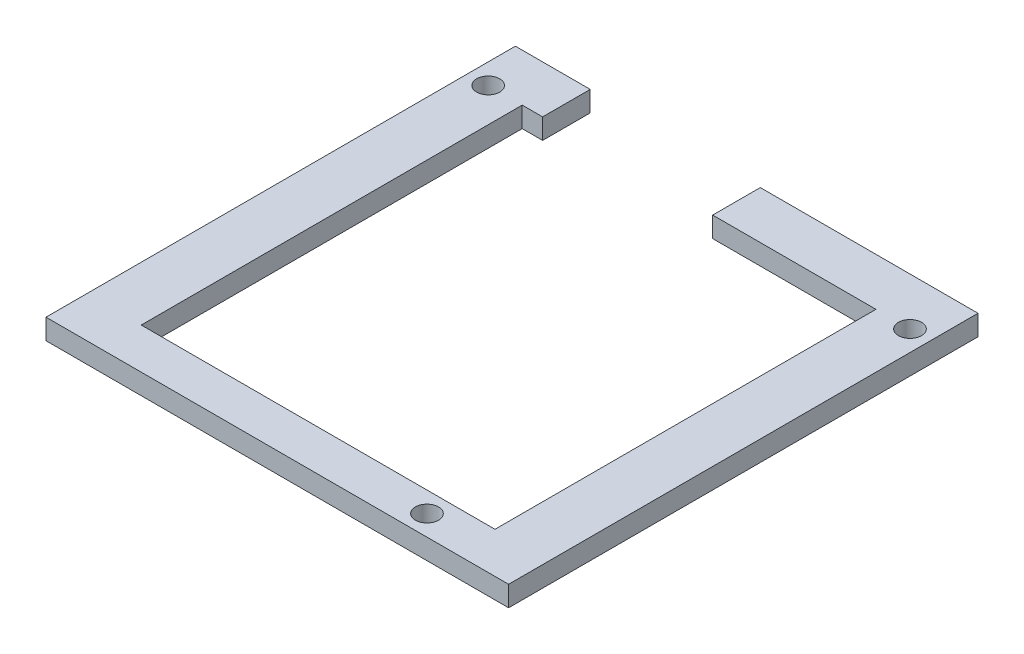
ISO-10303-21;
HEADER;
FILE_DESCRIPTION(('STEP AP214'),'2;1');
FILE_NAME('part.step','',(''),(''),'','','');
FILE_SCHEMA(('AUTOMOTIVE_DESIGN { 1 0 10303 214 1 1 1 1 }'));
ENDSEC;
DATA;
#1=APPLICATION_CONTEXT('core data for automotive mechanical design processes');
#2=APPLICATION_PROTOCOL_DEFINITION('international standard','automotive_design',2000,#1);
#3=PRODUCT_CONTEXT('',#1,'mechanical');
#4=PRODUCT('Part','Part','',(#3));
#5=PRODUCT_RELATED_PRODUCT_CATEGORY('part','',(#4));
#6=PRODUCT_DEFINITION_FORMATION('','',#4);
#7=PRODUCT_DEFINITION_CONTEXT('part definition',#1,'design');
#8=PRODUCT_DEFINITION('design','',#6,#7);
#9=PRODUCT_DEFINITION_SHAPE('','',#8);
#10=(LENGTH_UNIT() NAMED_UNIT(*) SI_UNIT(.MILLI.,.METRE.));
#11=(NAMED_UNIT(*) PLANE_ANGLE_UNIT() SI_UNIT($,.RADIAN.));
#12=(NAMED_UNIT(*) SI_UNIT($,.STERADIAN.) SOLID_ANGLE_UNIT());
#13=UNCERTAINTY_MEASURE_WITH_UNIT(LENGTH_MEASURE(1.E-05),#10,'distance_accuracy_value','');
#14=(GEOMETRIC_REPRESENTATION_CONTEXT(3) GLOBAL_UNCERTAINTY_ASSIGNED_CONTEXT((#13)) GLOBAL_UNIT_ASSIGNED_CONTEXT((#10,
#11,#12)) REPRESENTATION_CONTEXT('',''));
#15=CARTESIAN_POINT('',(0.,0.,0.));
#16=DIRECTION('',(0.,0.,1.));
#17=DIRECTION('',(1.,0.,0.));
#18=AXIS2_PLACEMENT_3D('',#15,#16,#17);
#19=CARTESIAN_POINT('',(-31.6988745927811,20.8489488177002,28.4869749490172));
#20=DIRECTION('',(0.,0.,1.));
#21=DIRECTION('',(1.,0.,0.));
#22=AXIS2_PLACEMENT_3D('',#19,#20,#21);
#23=PLANE('',#22);
#24=DIRECTION('',(-1.,0.,0.));
#25=VECTOR('',#24,1.);
#26=CARTESIAN_POINT('',(-31.6988745927811,17.8489488177002,28.4869749490172));
#27=LINE('',#26,#25);
#28=CARTESIAN_POINT('',(20.3011254072189,17.8489488177002,28.4869749490172));
#29=VERTEX_POINT('',#28);
#30=CARTESIAN_POINT('',(-3.69887459278107,17.8489488177001,28.4869749490172));
#31=VERTEX_POINT('',#30);
#32=EDGE_CURVE('E170',#29,#31,#27,.T.);
#33=ORIENTED_EDGE('',*,*,#32,.F.);
#34=DIRECTION('',(0.,-1.,0.));
#35=VECTOR('',#34,1.);
#36=CARTESIAN_POINT('',(20.3011254072189,20.8489488177002,28.4869749490172));
#37=LINE('',#36,#35);
#38=CARTESIAN_POINT('',(20.3011254072189,20.8489488177002,28.4869749490172));
#39=VERTEX_POINT('',#38);
#40=EDGE_CURVE('E53',#39,#29,#37,.T.);
#41=ORIENTED_EDGE('',*,*,#40,.F.);
#42=DIRECTION('',(-1.,0.,0.));
#43=VECTOR('',#42,1.);
#44=CARTESIAN_POINT('',(-31.6988745927811,20.8489488177002,28.4869749490172));
#45=LINE('',#44,#43);
#46=CARTESIAN_POINT('',(-3.69887459278107,20.8489488177002,28.4869749490172));
#47=VERTEX_POINT('',#46);
#48=EDGE_CURVE('E169',#39,#47,#45,.T.);
#49=ORIENTED_EDGE('',*,*,#48,.T.);
#50=DIRECTION('',(0.,1.,0.));
#51=VECTOR('',#50,1.);
#52=CARTESIAN_POINT('',(-3.69887459278107,-8.11256115379419,28.4869749490172));
#53=LINE('',#52,#51);
#54=EDGE_CURVE('E210',#31,#47,#53,.T.);
#55=ORIENTED_EDGE('',*,*,#54,.F.);
#56=EDGE_LOOP('',(#33,#41,#49,#55));
#57=FACE_BOUND('',#56,.T.);
#58=ADVANCED_FACE('F38',(#57),#23,.T.);
#59=CARTESIAN_POINT('',(-39.6988745927811,20.8489488177002,90.4869749490172));
#60=DIRECTION('',(1.,0.,0.));
#61=DIRECTION('',(0.,0.,-1.));
#62=AXIS2_PLACEMENT_3D('',#59,#60,#61);
#63=PLANE('',#62);
#64=DIRECTION('',(0.,0.,1.));
#65=VECTOR('',#64,1.);
#66=CARTESIAN_POINT('',(-39.6988745927811,17.8489488177002,90.4869749490172));
#67=LINE('',#66,#65);
#68=CARTESIAN_POINT('',(-39.6988745927811,17.8489488177002,21.4869749490172));
#69=VERTEX_POINT('',#68);
#70=CARTESIAN_POINT('',(-39.6988745927811,17.8489488177002,90.4869749490172));
#71=VERTEX_POINT('',#70);
#72=EDGE_CURVE('E144',#69,#71,#67,.T.);
#73=ORIENTED_EDGE('',*,*,#72,.T.);
#74=DIRECTION('',(0.,-1.,0.));
#75=VECTOR('',#74,1.);
#76=CARTESIAN_POINT('',(-39.6988745927811,20.8489488177002,90.4869749490172));
#77=LINE('',#76,#75);
#78=CARTESIAN_POINT('',(-39.6988745927811,20.8489488177002,90.4869749490172));
#79=VERTEX_POINT('',#78);
#80=EDGE_CURVE('E11',#79,#71,#77,.T.);
#81=ORIENTED_EDGE('',*,*,#80,.F.);
#82=DIRECTION('',(0.,0.,1.));
#83=VECTOR('',#82,1.);
#84=CARTESIAN_POINT('',(-39.6988745927811,20.8489488177002,90.4869749490172));
#85=LINE('',#84,#83);
#86=CARTESIAN_POINT('',(-39.6988745927811,20.8489488177002,21.4869749490172));
#87=VERTEX_POINT('',#86);
#88=EDGE_CURVE('E143',#87,#79,#85,.T.);
#89=ORIENTED_EDGE('',*,*,#88,.F.);
#90=DIRECTION('',(0.,1.,0.));
#91=VECTOR('',#90,1.);
#92=CARTESIAN_POINT('',(-39.6988745927811,20.8489488177002,21.4869749490172));
#93=LINE('',#92,#91);
#94=EDGE_CURVE('E199',#69,#87,#93,.T.);
#95=ORIENTED_EDGE('',*,*,#94,.F.);
#96=EDGE_LOOP('',(#73,#81,#89,#95));
#97=FACE_BOUND('',#96,.T.);
#98=ADVANCED_FACE('F40',(#97),#63,.F.);
#99=CARTESIAN_POINT('',(-39.6988745927811,20.8489488177002,90.4869749490172));
#100=DIRECTION('',(0.,0.,-1.));
#101=DIRECTION('',(-1.,0.,0.));
#102=AXIS2_PLACEMENT_3D('',#99,#100,#101);
#103=PLANE('',#102);
#104=DIRECTION('',(-1.,0.,0.));
#105=VECTOR('',#104,1.);
#106=CARTESIAN_POINT('',(-39.6988745927811,17.8489488177002,90.4869749490172));
#107=LINE('',#106,#105);
#108=CARTESIAN_POINT('',(28.3011254072189,17.8489488177002,90.4869749490172));
#109=VERTEX_POINT('',#108);
#110=EDGE_CURVE('E136',#109,#71,#107,.T.);
#111=ORIENTED_EDGE('',*,*,#110,.F.);
#112=DIRECTION('',(0.,-1.,0.));
#113=VECTOR('',#112,1.);
#114=CARTESIAN_POINT('',(28.3011254072189,20.8489488177002,90.4869749490172));
#115=LINE('',#114,#113);
#116=CARTESIAN_POINT('',(28.3011254072189,20.8489488177002,90.4869749490172));
#117=VERTEX_POINT('',#116);
#118=EDGE_CURVE('E46',#117,#109,#115,.T.);
#119=ORIENTED_EDGE('',*,*,#118,.F.);
#120=DIRECTION('',(1.,0.,0.));
#121=VECTOR('',#120,1.);
#122=CARTESIAN_POINT('',(-39.6988745927811,20.8489488177002,90.4869749490172));
#123=LINE('',#122,#121);
#124=EDGE_CURVE('E61',#79,#117,#123,.T.);
#125=ORIENTED_EDGE('',*,*,#124,.F.);
#126=ORIENTED_EDGE('',*,*,#80,.T.);
#127=EDGE_LOOP('',(#111,#119,#125,#126));
#128=FACE_BOUND('',#127,.T.);
#129=ADVANCED_FACE('F147',(#128),#103,.F.);
#130=CARTESIAN_POINT('',(28.3011254072189,20.8489488177002,90.4869749490172));
#131=DIRECTION('',(-1.,0.,0.));
#132=DIRECTION('',(0.,0.,1.));
#133=AXIS2_PLACEMENT_3D('',#130,#131,#132);
#134=PLANE('',#133);
#135=ORIENTED_EDGE('',*,*,#118,.T.);
#136=DIRECTION('',(0.,0.,-1.));
#137=VECTOR('',#136,1.);
#138=CARTESIAN_POINT('',(28.3011254072189,17.8489488177002,90.4869749490172));
#139=LINE('',#138,#137);
#140=CARTESIAN_POINT('',(28.3011254072189,17.8489488177002,21.4869749490172));
#141=VERTEX_POINT('',#140);
#142=EDGE_CURVE('E130',#109,#141,#139,.T.);
#143=ORIENTED_EDGE('',*,*,#142,.T.);
#144=DIRECTION('',(0.,-1.,0.));
#145=VECTOR('',#144,1.);
#146=CARTESIAN_POINT('',(28.3011254072189,20.8489488177002,21.4869749490172));
#147=LINE('',#146,#145);
#148=CARTESIAN_POINT('',(28.3011254072189,20.8489488177002,21.4869749490172));
#149=VERTEX_POINT('',#148);
#150=EDGE_CURVE('E204',#149,#141,#147,.T.);
#151=ORIENTED_EDGE('',*,*,#150,.F.);
#152=DIRECTION('',(0.,0.,-1.));
#153=VECTOR('',#152,1.);
#154=CARTESIAN_POINT('',(28.3011254072189,20.8489488177002,90.4869749490172));
#155=LINE('',#154,#153);
#156=EDGE_CURVE('E153',#117,#149,#155,.T.);
#157=ORIENTED_EDGE('',*,*,#156,.F.);
#158=EDGE_LOOP('',(#135,#143,#151,#157));
#159=FACE_BOUND('',#158,.T.);
#160=ADVANCED_FACE('F152',(#159),#134,.F.);
#161=CARTESIAN_POINT('',(-31.6988745927811,20.8489488177002,28.4869749490172));
#162=DIRECTION('',(1.,0.,0.));
#163=DIRECTION('',(0.,0.,-1.));
#164=AXIS2_PLACEMENT_3D('',#161,#162,#163);
#165=PLANE('',#164);
#166=DIRECTION('',(0.,-1.,0.));
#167=VECTOR('',#166,1.);
#168=CARTESIAN_POINT('',(-31.6988745927811,20.8489488177002,84.4869749490172));
#169=LINE('',#168,#167);
#170=CARTESIAN_POINT('',(-31.6988745927811,20.8489488177002,84.4869749490172));
#171=VERTEX_POINT('',#170);
#172=CARTESIAN_POINT('',(-31.6988745927811,17.8489488177002,84.4869749490172));
#173=VERTEX_POINT('',#172);
#174=EDGE_CURVE('E156',#171,#173,#169,.T.);
#175=ORIENTED_EDGE('',*,*,#174,.T.);
#176=DIRECTION('',(0.,0.,-1.));
#177=VECTOR('',#176,1.);
#178=CARTESIAN_POINT('',(-31.6988745927811,17.8489488177002,28.4869749490172));
#179=LINE('',#178,#177);
#180=CARTESIAN_POINT('',(-31.6988745927811,17.8489488177002,28.4869749490172));
#181=VERTEX_POINT('',#180);
#182=EDGE_CURVE('E223',#173,#181,#179,.T.);
#183=ORIENTED_EDGE('',*,*,#182,.T.);
#184=DIRECTION('',(0.,-1.,0.));
#185=VECTOR('',#184,1.);
#186=CARTESIAN_POINT('',(-31.6988745927811,20.8489488177002,28.4869749490172));
#187=LINE('',#186,#185);
#188=CARTESIAN_POINT('',(-31.6988745927811,20.8489488177002,28.4869749490172));
#189=VERTEX_POINT('',#188);
#190=EDGE_CURVE('E166',#189,#181,#187,.T.);
#191=ORIENTED_EDGE('',*,*,#190,.F.);
#192=DIRECTION('',(0.,0.,1.));
#193=VECTOR('',#192,1.);
#194=CARTESIAN_POINT('',(-31.6988745927811,20.8489488177002,28.4869749490172));
#195=LINE('',#194,#193);
#196=EDGE_CURVE('E173',#189,#171,#195,.T.);
#197=ORIENTED_EDGE('',*,*,#196,.T.);
#198=EDGE_LOOP('',(#175,#183,#191,#197));
#199=FACE_BOUND('',#198,.T.);
#200=ADVANCED_FACE('F235',(#199),#165,.T.);
#201=CARTESIAN_POINT('',(20.3011254072189,20.8489488177002,28.4869749490172));
#202=DIRECTION('',(-1.,0.,0.));
#203=DIRECTION('',(0.,0.,1.));
#204=AXIS2_PLACEMENT_3D('',#201,#202,#203);
#205=PLANE('',#204);
#206=ORIENTED_EDGE('',*,*,#40,.T.);
#207=DIRECTION('',(0.,0.,-1.));
#208=VECTOR('',#207,1.);
#209=CARTESIAN_POINT('',(20.3011254072189,17.8489488177002,28.4869749490172));
#210=LINE('',#209,#208);
#211=CARTESIAN_POINT('',(20.3011254072189,17.8489488177002,84.4869749490172));
#212=VERTEX_POINT('',#211);
#213=EDGE_CURVE('E175',#212,#29,#210,.T.);
#214=ORIENTED_EDGE('',*,*,#213,.F.);
#215=DIRECTION('',(0.,-1.,0.));
#216=VECTOR('',#215,1.);
#217=CARTESIAN_POINT('',(20.3011254072189,20.8489488177002,84.4869749490172));
#218=LINE('',#217,#216);
#219=CARTESIAN_POINT('',(20.3011254072189,20.8489488177002,84.4869749490172));
#220=VERTEX_POINT('',#219);
#221=EDGE_CURVE('E162',#220,#212,#218,.T.);
#222=ORIENTED_EDGE('',*,*,#221,.F.);
#223=DIRECTION('',(0.,0.,-1.));
#224=VECTOR('',#223,1.);
#225=CARTESIAN_POINT('',(20.3011254072189,20.8489488177002,28.4869749490172));
#226=LINE('',#225,#224);
#227=EDGE_CURVE('E182',#220,#39,#226,.T.);
#228=ORIENTED_EDGE('',*,*,#227,.T.);
#229=EDGE_LOOP('',(#206,#214,#222,#228));
#230=FACE_BOUND('',#229,.T.);
#231=ADVANCED_FACE('F257',(#230),#205,.T.);
#232=CARTESIAN_POINT('',(25.3011254072189,17.8489488177002,28.4869749490172));
#233=DIRECTION('',(0.,1.,0.));
#234=DIRECTION('',(0.,0.,1.));
#235=AXIS2_PLACEMENT_3D('',#232,#233,#234);
#236=CYLINDRICAL_SURFACE('',#235,1.70000000000001);
#237=CARTESIAN_POINT('',(25.3011254072189,20.8489488177002,28.4869749490172));
#238=DIRECTION('',(0.,1.,0.));
#239=DIRECTION('',(0.,0.,1.));
#240=AXIS2_PLACEMENT_3D('',#237,#238,#239);
#241=CIRCLE('',#240,1.70000000000001);
#242=CARTESIAN_POINT('',(25.3011254072189,20.8489488177002,30.1869749490172));
#243=VERTEX_POINT('',#242);
#244=EDGE_CURVE('E187',#243,#243,#241,.T.);
#245=ORIENTED_EDGE('',*,*,#244,.T.);
#246=EDGE_LOOP('',(#245));
#247=FACE_BOUND('',#246,.T.);
#248=CARTESIAN_POINT('',(25.3011254072189,17.8489488177002,28.4869749490172));
#249=DIRECTION('',(0.,-1.,0.));
#250=DIRECTION('',(0.,0.,-1.));
#251=AXIS2_PLACEMENT_3D('',#248,#249,#250);
#252=CIRCLE('',#251,1.70000000000001);
#253=CARTESIAN_POINT('',(25.3011254072189,17.8489488177002,26.7869749490172));
#254=VERTEX_POINT('',#253);
#255=EDGE_CURVE('E225',#254,#254,#252,.F.);
#256=ORIENTED_EDGE('',*,*,#255,.F.);
#257=EDGE_LOOP('',(#256));
#258=FACE_BOUND('',#257,.T.);
#259=ADVANCED_FACE('F321',(#247,#258),#236,.F.);
#260=CARTESIAN_POINT('',(13.3011254072189,17.8489488177002,87.4869749490172));
#261=DIRECTION('',(0.,1.,0.));
#262=DIRECTION('',(0.,0.,1.));
#263=AXIS2_PLACEMENT_3D('',#260,#261,#262);
#264=CYLINDRICAL_SURFACE('',#263,1.7);
#265=CARTESIAN_POINT('',(13.3011254072189,20.8489488177002,87.4869749490172));
#266=DIRECTION('',(0.,1.,0.));
#267=DIRECTION('',(0.,0.,1.));
#268=AXIS2_PLACEMENT_3D('',#265,#266,#267);
#269=CIRCLE('',#268,1.7);
#270=CARTESIAN_POINT('',(13.3011254072189,20.8489488177002,89.1869749490172));
#271=VERTEX_POINT('',#270);
#272=EDGE_CURVE('E190',#271,#271,#269,.T.);
#273=ORIENTED_EDGE('',*,*,#272,.T.);
#274=EDGE_LOOP('',(#273));
#275=FACE_BOUND('',#274,.T.);
#276=CARTESIAN_POINT('',(13.3011254072189,17.8489488177002,87.4869749490172));
#277=DIRECTION('',(0.,-1.,0.));
#278=DIRECTION('',(0.,0.,-1.));
#279=AXIS2_PLACEMENT_3D('',#276,#277,#278);
#280=CIRCLE('',#279,1.7);
#281=CARTESIAN_POINT('',(13.3011254072189,17.8489488177002,85.7869749490172));
#282=VERTEX_POINT('',#281);
#283=EDGE_CURVE('E228',#282,#282,#280,.F.);
#284=ORIENTED_EDGE('',*,*,#283,.F.);
#285=EDGE_LOOP('',(#284));
#286=FACE_BOUND('',#285,.T.);
#287=ADVANCED_FACE('F275',(#275,#286),#264,.F.);
#288=CARTESIAN_POINT('',(-36.6988745927811,17.8489488177002,28.4869749490172));
#289=DIRECTION('',(0.,1.,0.));
#290=DIRECTION('',(0.,0.,1.));
#291=AXIS2_PLACEMENT_3D('',#288,#289,#290);
#292=CYLINDRICAL_SURFACE('',#291,1.70000000000001);
#293=CARTESIAN_POINT('',(-36.6988745927811,20.8489488177002,28.4869749490172));
#294=DIRECTION('',(0.,1.,0.));
#295=DIRECTION('',(0.,0.,1.));
#296=AXIS2_PLACEMENT_3D('',#293,#294,#295);
#297=CIRCLE('',#296,1.70000000000001);
#298=CARTESIAN_POINT('',(-36.6988745927811,20.8489488177002,30.1869749490172));
#299=VERTEX_POINT('',#298);
#300=EDGE_CURVE('E179',#299,#299,#297,.T.);
#301=ORIENTED_EDGE('',*,*,#300,.T.);
#302=EDGE_LOOP('',(#301));
#303=FACE_BOUND('',#302,.T.);
#304=CARTESIAN_POINT('',(-36.6988745927811,17.8489488177002,28.4869749490172));
#305=DIRECTION('',(0.,-1.,0.));
#306=DIRECTION('',(0.,0.,-1.));
#307=AXIS2_PLACEMENT_3D('',#304,#305,#306);
#308=CIRCLE('',#307,1.70000000000001);
#309=CARTESIAN_POINT('',(-36.6988745927811,17.8489488177002,26.7869749490172));
#310=VERTEX_POINT('',#309);
#311=EDGE_CURVE('E150',#310,#310,#308,.F.);
#312=ORIENTED_EDGE('',*,*,#311,.F.);
#313=EDGE_LOOP('',(#312));
#314=FACE_BOUND('',#313,.T.);
#315=ADVANCED_FACE('F266',(#303,#314),#292,.F.);
#316=CARTESIAN_POINT('',(0.,0.,21.4869749490172));
#317=DIRECTION('',(0.,0.,-1.));
#318=DIRECTION('',(-1.,0.,0.));
#319=AXIS2_PLACEMENT_3D('',#316,#317,#318);
#320=PLANE('',#319);
#321=DIRECTION('',(0.,1.,0.));
#322=VECTOR('',#321,1.);
#323=CARTESIAN_POINT('',(-3.69887459278107,-8.11256115379419,21.4869749490172));
#324=LINE('',#323,#322);
#325=CARTESIAN_POINT('',(-3.69887459278107,17.8489488177002,21.4869749490172));
#326=VERTEX_POINT('',#325);
#327=CARTESIAN_POINT('',(-3.69887459278107,20.8489488177002,21.4869749490172));
#328=VERTEX_POINT('',#327);
#329=EDGE_CURVE('E214',#326,#328,#324,.T.);
#330=ORIENTED_EDGE('',*,*,#329,.T.);
#331=DIRECTION('',(1.,0.,0.));
#332=VECTOR('',#331,1.);
#333=CARTESIAN_POINT('',(28.3011254072189,20.8489488177002,21.4869749490172));
#334=LINE('',#333,#332);
#335=EDGE_CURVE('E198',#328,#149,#334,.T.);
#336=ORIENTED_EDGE('',*,*,#335,.T.);
#337=ORIENTED_EDGE('',*,*,#150,.T.);
#338=DIRECTION('',(-1.,0.,0.));
#339=VECTOR('',#338,1.);
#340=CARTESIAN_POINT('',(28.3011254072189,17.8489488177002,21.4869749490172));
#341=LINE('',#340,#339);
#342=EDGE_CURVE('E138',#141,#326,#341,.T.);
#343=ORIENTED_EDGE('',*,*,#342,.T.);
#344=EDGE_LOOP('',(#330,#336,#337,#343));
#345=FACE_BOUND('',#344,.T.);
#346=ADVANCED_FACE('F264',(#345),#320,.T.);
#347=CARTESIAN_POINT('',(-39.6988745927811,20.8489488177002,90.4869749490172));
#348=DIRECTION('',(0.,-1.,0.));
#349=DIRECTION('',(0.,0.,-1.));
#350=AXIS2_PLACEMENT_3D('',#347,#348,#349);
#351=PLANE('',#350);
#352=ORIENTED_EDGE('',*,*,#300,.F.);
#353=EDGE_LOOP('',(#352));
#354=FACE_BOUND('',#353,.T.);
#355=ORIENTED_EDGE('',*,*,#272,.F.);
#356=EDGE_LOOP('',(#355));
#357=FACE_BOUND('',#356,.T.);
#358=ORIENTED_EDGE('',*,*,#244,.F.);
#359=EDGE_LOOP('',(#358));
#360=FACE_BOUND('',#359,.T.);
#361=ORIENTED_EDGE('',*,*,#335,.F.);
#362=DIRECTION('',(0.,0.,-1.));
#363=VECTOR('',#362,1.);
#364=CARTESIAN_POINT('',(-3.69887459278107,20.8489488177002,28.4869749490172));
#365=LINE('',#364,#363);
#366=EDGE_CURVE('E213',#47,#328,#365,.T.);
#367=ORIENTED_EDGE('',*,*,#366,.F.);
#368=ORIENTED_EDGE('',*,*,#48,.F.);
#369=ORIENTED_EDGE('',*,*,#227,.F.);
#370=DIRECTION('',(1.,0.,0.));
#371=VECTOR('',#370,1.);
#372=CARTESIAN_POINT('',(-31.6988745927811,20.8489488177002,84.4869749490172));
#373=LINE('',#372,#371);
#374=EDGE_CURVE('E184',#171,#220,#373,.T.);
#375=ORIENTED_EDGE('',*,*,#374,.F.);
#376=ORIENTED_EDGE('',*,*,#196,.F.);
#377=CARTESIAN_POINT('',(-28.6988745927811,20.8489488177002,28.4869749490172));
#378=VERTEX_POINT('',#377);
#379=EDGE_CURVE('E181',#378,#189,#45,.T.);
#380=ORIENTED_EDGE('',*,*,#379,.F.);
#381=DIRECTION('',(0.,0.,1.));
#382=VECTOR('',#381,1.);
#383=CARTESIAN_POINT('',(-28.6988745927811,20.8489488177002,28.4869749490172));
#384=LINE('',#383,#382);
#385=CARTESIAN_POINT('',(-28.6988745927811,20.8489488177002,21.4869749490172));
#386=VERTEX_POINT('',#385);
#387=EDGE_CURVE('E221',#386,#378,#384,.T.);
#388=ORIENTED_EDGE('',*,*,#387,.F.);
#389=EDGE_CURVE('E191',#87,#386,#334,.T.);
#390=ORIENTED_EDGE('',*,*,#389,.F.);
#391=ORIENTED_EDGE('',*,*,#88,.T.);
#392=ORIENTED_EDGE('',*,*,#124,.T.);
#393=ORIENTED_EDGE('',*,*,#156,.T.);
#394=EDGE_LOOP('',(#361,#367,#368,#369,#375,#376,#380,#388,#390,#391,#392,#393));
#395=FACE_BOUND('',#394,.T.);
#396=ADVANCED_FACE('F247',(#354,#357,#360,#395),#351,.F.);
#397=CARTESIAN_POINT('',(-39.6988745927811,17.8489488177002,90.4869749490172));
#398=DIRECTION('',(0.,-1.,0.));
#399=DIRECTION('',(0.,0.,-1.));
#400=AXIS2_PLACEMENT_3D('',#397,#398,#399);
#401=PLANE('',#400);
#402=CARTESIAN_POINT('',(-28.6988745927811,17.8489488177002,28.4869749490172));
#403=VERTEX_POINT('',#402);
#404=EDGE_CURVE('E174',#403,#181,#27,.T.);
#405=ORIENTED_EDGE('',*,*,#404,.T.);
#406=ORIENTED_EDGE('',*,*,#182,.F.);
#407=DIRECTION('',(1.,0.,0.));
#408=VECTOR('',#407,1.);
#409=CARTESIAN_POINT('',(-31.6988745927811,17.8489488177002,84.4869749490172));
#410=LINE('',#409,#408);
#411=EDGE_CURVE('E177',#173,#212,#410,.T.);
#412=ORIENTED_EDGE('',*,*,#411,.T.);
#413=ORIENTED_EDGE('',*,*,#213,.T.);
#414=ORIENTED_EDGE('',*,*,#32,.T.);
#415=DIRECTION('',(0.,0.,-1.));
#416=VECTOR('',#415,1.);
#417=CARTESIAN_POINT('',(-3.69887459278107,17.8489488177002,28.4869749490172));
#418=LINE('',#417,#416);
#419=EDGE_CURVE('E212',#31,#326,#418,.T.);
#420=ORIENTED_EDGE('',*,*,#419,.T.);
#421=ORIENTED_EDGE('',*,*,#342,.F.);
#422=ORIENTED_EDGE('',*,*,#142,.F.);
#423=ORIENTED_EDGE('',*,*,#110,.T.);
#424=ORIENTED_EDGE('',*,*,#72,.F.);
#425=CARTESIAN_POINT('',(-28.6988745927811,17.8489488177002,21.4869749490172));
#426=VERTEX_POINT('',#425);
#427=EDGE_CURVE('E203',#426,#69,#341,.T.);
#428=ORIENTED_EDGE('',*,*,#427,.F.);
#429=DIRECTION('',(0.,0.,1.));
#430=VECTOR('',#429,1.);
#431=CARTESIAN_POINT('',(-28.6988745927811,17.8489488177002,28.4869749490172));
#432=LINE('',#431,#430);
#433=EDGE_CURVE('E209',#426,#403,#432,.T.);
#434=ORIENTED_EDGE('',*,*,#433,.T.);
#435=EDGE_LOOP('',(#405,#406,#412,#413,#414,#420,#421,#422,#423,#424,#428,#434));
#436=FACE_BOUND('',#435,.T.);
#437=ORIENTED_EDGE('',*,*,#311,.T.);
#438=EDGE_LOOP('',(#437));
#439=FACE_BOUND('',#438,.T.);
#440=ORIENTED_EDGE('',*,*,#283,.T.);
#441=EDGE_LOOP('',(#440));
#442=FACE_BOUND('',#441,.T.);
#443=ORIENTED_EDGE('',*,*,#255,.T.);
#444=EDGE_LOOP('',(#443));
#445=FACE_BOUND('',#444,.T.);
#446=ADVANCED_FACE('F133',(#436,#439,#442,#445),#401,.T.);
#447=CARTESIAN_POINT('',(-31.6988745927811,20.8489488177002,84.4869749490172));
#448=DIRECTION('',(0.,0.,-1.));
#449=DIRECTION('',(-1.,0.,0.));
#450=AXIS2_PLACEMENT_3D('',#447,#448,#449);
#451=PLANE('',#450);
#452=ORIENTED_EDGE('',*,*,#411,.F.);
#453=ORIENTED_EDGE('',*,*,#174,.F.);
#454=ORIENTED_EDGE('',*,*,#374,.T.);
#455=ORIENTED_EDGE('',*,*,#221,.T.);
#456=EDGE_LOOP('',(#452,#453,#454,#455));
#457=FACE_BOUND('',#456,.T.);
#458=ADVANCED_FACE('F252',(#457),#451,.T.);
#459=DIRECTION('',(0.,1.,0.));
#460=VECTOR('',#459,1.);
#461=CARTESIAN_POINT('',(-28.6988745927811,-8.11256115379419,28.4869749490172));
#462=LINE('',#461,#460);
#463=EDGE_CURVE('E206',#403,#378,#462,.T.);
#464=ORIENTED_EDGE('',*,*,#463,.T.);
#465=ORIENTED_EDGE('',*,*,#379,.T.);
#466=ORIENTED_EDGE('',*,*,#190,.T.);
#467=ORIENTED_EDGE('',*,*,#404,.F.);
#468=EDGE_LOOP('',(#464,#465,#466,#467));
#469=FACE_BOUND('',#468,.T.);
#470=ADVANCED_FACE('F243',(#469),#23,.T.);
#471=DIRECTION('',(0.,1.,0.));
#472=VECTOR('',#471,1.);
#473=CARTESIAN_POINT('',(-28.6988745927811,-8.11256115379419,21.4869749490172));
#474=LINE('',#473,#472);
#475=EDGE_CURVE('E217',#426,#386,#474,.T.);
#476=ORIENTED_EDGE('',*,*,#475,.F.);
#477=ORIENTED_EDGE('',*,*,#427,.T.);
#478=ORIENTED_EDGE('',*,*,#94,.T.);
#479=ORIENTED_EDGE('',*,*,#389,.T.);
#480=EDGE_LOOP('',(#476,#477,#478,#479));
#481=FACE_BOUND('',#480,.T.);
#482=ADVANCED_FACE('F268',(#481),#320,.T.);
#483=CARTESIAN_POINT('',(-3.69887459278107,-8.11256115379419,28.4869749490172));
#484=DIRECTION('',(1.,0.,0.));
#485=DIRECTION('',(0.,0.,-1.));
#486=AXIS2_PLACEMENT_3D('',#483,#484,#485);
#487=PLANE('',#486);
#488=ORIENTED_EDGE('',*,*,#54,.T.);
#489=ORIENTED_EDGE('',*,*,#366,.T.);
#490=ORIENTED_EDGE('',*,*,#329,.F.);
#491=ORIENTED_EDGE('',*,*,#419,.F.);
#492=EDGE_LOOP('',(#488,#489,#490,#491));
#493=FACE_BOUND('',#492,.T.);
#494=ADVANCED_FACE('F262',(#493),#487,.F.);
#495=CARTESIAN_POINT('',(-28.6988745927811,-8.11256115379419,28.4869749490172));
#496=DIRECTION('',(-1.,0.,0.));
#497=DIRECTION('',(0.,0.,1.));
#498=AXIS2_PLACEMENT_3D('',#495,#496,#497);
#499=PLANE('',#498);
#500=ORIENTED_EDGE('',*,*,#475,.T.);
#501=ORIENTED_EDGE('',*,*,#387,.T.);
#502=ORIENTED_EDGE('',*,*,#463,.F.);
#503=ORIENTED_EDGE('',*,*,#433,.F.);
#504=EDGE_LOOP('',(#500,#501,#502,#503));
#505=FACE_BOUND('',#504,.T.);
#506=ADVANCED_FACE('F368',(#505),#499,.F.);
#507=CLOSED_SHELL('',(#58,#98,#129,#160,#200,#231,#259,#287,#315,#346,#396,#446,#458,#470,#482,
#494,#506));
#508=MANIFOLD_SOLID_BREP('B2',#507);
#509=ADVANCED_BREP_SHAPE_REPRESENTATION('',(#18,#508),#14);
#510=SHAPE_DEFINITION_REPRESENTATION(#9,#509);
ENDSEC;
END-ISO-10303-21;
